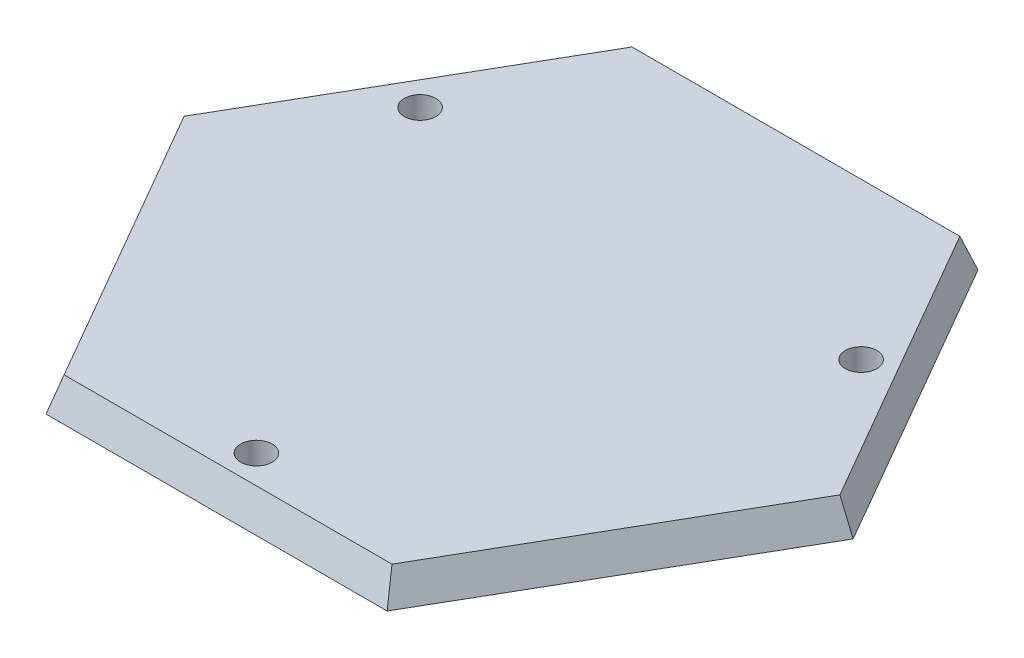
ISO-10303-21;
HEADER;
FILE_DESCRIPTION(('STEP AP214'),'2;1');
FILE_NAME('part.step','',(''),(''),'','','');
FILE_SCHEMA(('AUTOMOTIVE_DESIGN { 1 0 10303 214 1 1 1 1 }'));
ENDSEC;
DATA;
#1=APPLICATION_CONTEXT('core data for automotive mechanical design processes');
#2=APPLICATION_PROTOCOL_DEFINITION('international standard','automotive_design',2000,#1);
#3=PRODUCT_CONTEXT('',#1,'mechanical');
#4=PRODUCT('Part','Part','',(#3));
#5=PRODUCT_RELATED_PRODUCT_CATEGORY('part','',(#4));
#6=PRODUCT_DEFINITION_FORMATION('','',#4);
#7=PRODUCT_DEFINITION_CONTEXT('part definition',#1,'design');
#8=PRODUCT_DEFINITION('design','',#6,#7);
#9=PRODUCT_DEFINITION_SHAPE('','',#8);
#10=(LENGTH_UNIT() NAMED_UNIT(*) SI_UNIT(.MILLI.,.METRE.));
#11=(NAMED_UNIT(*) PLANE_ANGLE_UNIT() SI_UNIT($,.RADIAN.));
#12=(NAMED_UNIT(*) SI_UNIT($,.STERADIAN.) SOLID_ANGLE_UNIT());
#13=UNCERTAINTY_MEASURE_WITH_UNIT(LENGTH_MEASURE(1.E-05),#10,'distance_accuracy_value','');
#14=(GEOMETRIC_REPRESENTATION_CONTEXT(3) GLOBAL_UNCERTAINTY_ASSIGNED_CONTEXT((#13)) GLOBAL_UNIT_ASSIGNED_CONTEXT((#10,
#11,#12)) REPRESENTATION_CONTEXT('',''));
#15=CARTESIAN_POINT('',(0.,0.,0.));
#16=DIRECTION('',(0.,0.,1.));
#17=DIRECTION('',(1.,0.,0.));
#18=AXIS2_PLACEMENT_3D('',#15,#16,#17);
#19=CARTESIAN_POINT('',(-51.9615242270663,0.,-89.9999999999999));
#20=DIRECTION('',(-0.813797681349373,0.342020143325669,-0.469846310392954));
#21=DIRECTION('',(-0.5,0.,0.866025403784438));
#22=AXIS2_PLACEMENT_3D('',#19,#20,#21);
#23=PLANE('',#22);
#24=DIRECTION('',(-0.5,0.,0.866025403784439));
#25=VECTOR('',#24,1.);
#26=CARTESIAN_POINT('',(-51.9615242270663,0.,-89.9999999999999));
#27=LINE('',#26,#25);
#28=CARTESIAN_POINT('',(-51.9615242270663,0.,-89.9999999999999));
#29=VERTEX_POINT('',#28);
#30=CARTESIAN_POINT('',(-103.923048454133,0.,0.));
#31=VERTEX_POINT('',#30);
#32=EDGE_CURVE('E102',#29,#31,#27,.T.);
#33=ORIENTED_EDGE('',*,*,#32,.F.);
#34=DIRECTION('',(0.193724626205288,0.921891033043757,0.335540895264848));
#35=VECTOR('',#34,1.);
#36=CARTESIAN_POINT('',(-48.0613721563601,18.5599285538483,-83.2447384562918));
#37=LINE('',#36,#35);
#38=CARTESIAN_POINT('',(-54.0629073543724,-10.,-93.6397023426619));
#39=VERTEX_POINT('',#38);
#40=EDGE_CURVE('E11',#39,#29,#37,.T.);
#41=ORIENTED_EDGE('',*,*,#40,.F.);
#42=DIRECTION('',(-0.5,0.,0.866025403784438));
#43=VECTOR('',#42,1.);
#44=CARTESIAN_POINT('',(-81.0943610315585,-10.,-46.819851171331));
#45=LINE('',#44,#43);
#46=CARTESIAN_POINT('',(-108.125814708745,-10.,0.));
#47=VERTEX_POINT('',#46);
#48=EDGE_CURVE('E104',#39,#47,#45,.T.);
#49=ORIENTED_EDGE('',*,*,#48,.T.);
#50=DIRECTION('',(0.387449252410576,0.921891033043757,0.));
#51=VECTOR('',#50,1.);
#52=CARTESIAN_POINT('',(-96.1227443127202,18.5599285538483,0.));
#53=LINE('',#52,#51);
#54=EDGE_CURVE('E80',#47,#31,#53,.T.);
#55=ORIENTED_EDGE('',*,*,#54,.T.);
#56=EDGE_LOOP('',(#33,#41,#49,#55));
#57=FACE_BOUND('',#56,.T.);
#58=ADVANCED_FACE('F37',(#57),#23,.T.);
#59=CARTESIAN_POINT('',(51.9615242270663,0.,-89.9999999999999));
#60=DIRECTION('',(0.,0.342020143325669,-0.939692620785908));
#61=DIRECTION('',(0.,0.939692620785908,0.342020143325669));
#62=AXIS2_PLACEMENT_3D('',#59,#60,#61);
#63=PLANE('',#62);
#64=DIRECTION('',(-1.,0.,0.));
#65=VECTOR('',#64,1.);
#66=CARTESIAN_POINT('',(51.9615242270663,0.,-89.9999999999999));
#67=LINE('',#66,#65);
#68=CARTESIAN_POINT('',(51.9615242270663,0.,-89.9999999999999));
#69=VERTEX_POINT('',#68);
#70=EDGE_CURVE('E115',#69,#29,#67,.T.);
#71=ORIENTED_EDGE('',*,*,#70,.F.);
#72=DIRECTION('',(-0.193724626205288,0.921891033043757,0.335540895264848));
#73=VECTOR('',#72,1.);
#74=CARTESIAN_POINT('',(48.0613721563601,18.5599285538483,-83.2447384562918));
#75=LINE('',#74,#73);
#76=CARTESIAN_POINT('',(54.0629073543724,-10.,-93.639702342662));
#77=VERTEX_POINT('',#76);
#78=EDGE_CURVE('E47',#77,#69,#75,.T.);
#79=ORIENTED_EDGE('',*,*,#78,.F.);
#80=DIRECTION('',(-1.,0.,0.));
#81=VECTOR('',#80,1.);
#82=CARTESIAN_POINT('',(0.,-10.,-93.639702342662));
#83=LINE('',#82,#81);
#84=EDGE_CURVE('E105',#77,#39,#83,.T.);
#85=ORIENTED_EDGE('',*,*,#84,.T.);
#86=ORIENTED_EDGE('',*,*,#40,.T.);
#87=EDGE_LOOP('',(#71,#79,#85,#86));
#88=FACE_BOUND('',#87,.T.);
#89=ADVANCED_FACE('F39',(#88),#63,.T.);
#90=CARTESIAN_POINT('',(103.923048454133,0.,0.));
#91=DIRECTION('',(0.813797681349373,0.342020143325669,-0.469846310392954));
#92=DIRECTION('',(-0.5,0.,-0.866025403784439));
#93=AXIS2_PLACEMENT_3D('',#90,#91,#92);
#94=PLANE('',#93);
#95=DIRECTION('',(-0.5,0.,-0.866025403784439));
#96=VECTOR('',#95,1.);
#97=CARTESIAN_POINT('',(103.923048454133,0.,0.));
#98=LINE('',#97,#96);
#99=CARTESIAN_POINT('',(103.923048454133,0.,0.));
#100=VERTEX_POINT('',#99);
#101=EDGE_CURVE('E129',#100,#69,#98,.T.);
#102=ORIENTED_EDGE('',*,*,#101,.F.);
#103=DIRECTION('',(-0.387449252410576,0.921891033043757,0.));
#104=VECTOR('',#103,1.);
#105=CARTESIAN_POINT('',(96.1227443127201,18.5599285538483,0.));
#106=LINE('',#105,#104);
#107=CARTESIAN_POINT('',(108.125814708745,-10.,0.));
#108=VERTEX_POINT('',#107);
#109=EDGE_CURVE('E135',#108,#100,#106,.T.);
#110=ORIENTED_EDGE('',*,*,#109,.F.);
#111=DIRECTION('',(-0.5,0.,-0.866025403784439));
#112=VECTOR('',#111,1.);
#113=CARTESIAN_POINT('',(81.0943610315585,-10.,-46.819851171331));
#114=LINE('',#113,#112);
#115=EDGE_CURVE('E140',#108,#77,#114,.T.);
#116=ORIENTED_EDGE('',*,*,#115,.T.);
#117=ORIENTED_EDGE('',*,*,#78,.T.);
#118=EDGE_LOOP('',(#102,#110,#116,#117));
#119=FACE_BOUND('',#118,.T.);
#120=ADVANCED_FACE('F154',(#119),#94,.T.);
#121=CARTESIAN_POINT('',(51.9615242270663,0.,90.));
#122=DIRECTION('',(0.813797681349373,0.342020143325669,0.469846310392954));
#123=DIRECTION('',(0.5,0.,-0.866025403784439));
#124=AXIS2_PLACEMENT_3D('',#121,#122,#123);
#125=PLANE('',#124);
#126=DIRECTION('',(0.5,0.,-0.866025403784439));
#127=VECTOR('',#126,1.);
#128=CARTESIAN_POINT('',(51.9615242270663,0.,90.));
#129=LINE('',#128,#127);
#130=CARTESIAN_POINT('',(51.9615242270663,0.,90.));
#131=VERTEX_POINT('',#130);
#132=EDGE_CURVE('E126',#131,#100,#129,.T.);
#133=ORIENTED_EDGE('',*,*,#132,.F.);
#134=DIRECTION('',(-0.193724626205288,0.921891033043757,-0.335540895264848));
#135=VECTOR('',#134,1.);
#136=CARTESIAN_POINT('',(48.06137215636,18.5599285538483,83.2447384562918));
#137=LINE('',#136,#135);
#138=CARTESIAN_POINT('',(54.0629073543723,-10.,93.639702342662));
#139=VERTEX_POINT('',#138);
#140=EDGE_CURVE('E133',#139,#131,#137,.T.);
#141=ORIENTED_EDGE('',*,*,#140,.F.);
#142=DIRECTION('',(0.5,0.,-0.866025403784439));
#143=VECTOR('',#142,1.);
#144=CARTESIAN_POINT('',(81.0943610315585,-10.,46.819851171331));
#145=LINE('',#144,#143);
#146=EDGE_CURVE('E142',#139,#108,#145,.T.);
#147=ORIENTED_EDGE('',*,*,#146,.T.);
#148=ORIENTED_EDGE('',*,*,#109,.T.);
#149=EDGE_LOOP('',(#133,#141,#147,#148));
#150=FACE_BOUND('',#149,.T.);
#151=ADVANCED_FACE('F152',(#150),#125,.T.);
#152=CARTESIAN_POINT('',(-51.9615242270663,0.,90.));
#153=DIRECTION('',(0.,0.342020143325669,0.939692620785908));
#154=DIRECTION('',(0.,-0.939692620785908,0.342020143325669));
#155=AXIS2_PLACEMENT_3D('',#152,#153,#154);
#156=PLANE('',#155);
#157=DIRECTION('',(1.,0.,0.));
#158=VECTOR('',#157,1.);
#159=CARTESIAN_POINT('',(-51.9615242270663,0.,90.));
#160=LINE('',#159,#158);
#161=CARTESIAN_POINT('',(-51.9615242270663,0.,90.));
#162=VERTEX_POINT('',#161);
#163=EDGE_CURVE('E112',#162,#131,#160,.T.);
#164=ORIENTED_EDGE('',*,*,#163,.F.);
#165=DIRECTION('',(0.193724626205288,0.921891033043757,-0.335540895264848));
#166=VECTOR('',#165,1.);
#167=CARTESIAN_POINT('',(-48.06137215636,18.5599285538483,83.2447384562919));
#168=LINE('',#167,#166);
#169=CARTESIAN_POINT('',(-54.0629073543723,-10.,93.639702342662));
#170=VERTEX_POINT('',#169);
#171=EDGE_CURVE('E73',#170,#162,#168,.T.);
#172=ORIENTED_EDGE('',*,*,#171,.F.);
#173=DIRECTION('',(1.,0.,0.));
#174=VECTOR('',#173,1.);
#175=CARTESIAN_POINT('',(0.,-10.,93.639702342662));
#176=LINE('',#175,#174);
#177=EDGE_CURVE('E144',#170,#139,#176,.T.);
#178=ORIENTED_EDGE('',*,*,#177,.T.);
#179=ORIENTED_EDGE('',*,*,#140,.T.);
#180=EDGE_LOOP('',(#164,#172,#178,#179));
#181=FACE_BOUND('',#180,.T.);
#182=ADVANCED_FACE('F153',(#181),#156,.T.);
#183=CARTESIAN_POINT('',(-103.923048454133,0.,0.));
#184=DIRECTION('',(-0.813797681349373,0.342020143325669,0.469846310392954));
#185=DIRECTION('',(0.5,0.,0.866025403784439));
#186=AXIS2_PLACEMENT_3D('',#183,#184,#185);
#187=PLANE('',#186);
#188=DIRECTION('',(0.5,0.,0.866025403784439));
#189=VECTOR('',#188,1.);
#190=CARTESIAN_POINT('',(-103.923048454133,0.,0.));
#191=LINE('',#190,#189);
#192=EDGE_CURVE('E108',#31,#162,#191,.T.);
#193=ORIENTED_EDGE('',*,*,#192,.F.);
#194=ORIENTED_EDGE('',*,*,#54,.F.);
#195=DIRECTION('',(0.5,0.,0.866025403784439));
#196=VECTOR('',#195,1.);
#197=CARTESIAN_POINT('',(-81.0943610315585,-10.,46.819851171331));
#198=LINE('',#197,#196);
#199=EDGE_CURVE('E41',#47,#170,#198,.T.);
#200=ORIENTED_EDGE('',*,*,#199,.T.);
#201=ORIENTED_EDGE('',*,*,#171,.T.);
#202=EDGE_LOOP('',(#193,#194,#200,#201));
#203=FACE_BOUND('',#202,.T.);
#204=ADVANCED_FACE('F109',(#203),#187,.T.);
#205=CARTESIAN_POINT('',(0.,-10.,0.));
#206=DIRECTION('',(0.,1.,0.));
#207=DIRECTION('',(0.,0.,1.));
#208=AXIS2_PLACEMENT_3D('',#205,#206,#207);
#209=PLANE('',#208);
#210=CARTESIAN_POINT('',(-68.9422863405994,-10.,-39.8038475772933));
#211=DIRECTION('',(0.,1.,0.));
#212=DIRECTION('',(0.,0.,1.));
#213=AXIS2_PLACEMENT_3D('',#210,#211,#212);
#214=CIRCLE('',#213,5.00000000000001);
#215=CARTESIAN_POINT('',(-68.9422863405994,-10.,-34.8038475772933));
#216=VERTEX_POINT('',#215);
#217=EDGE_CURVE('E116',#216,#216,#214,.F.);
#218=ORIENTED_EDGE('',*,*,#217,.F.);
#219=EDGE_LOOP('',(#218));
#220=FACE_BOUND('',#219,.T.);
#221=CARTESIAN_POINT('',(70.1480577065395,-10.,-40.5));
#222=DIRECTION('',(0.,1.,0.));
#223=DIRECTION('',(0.,0.,1.));
#224=AXIS2_PLACEMENT_3D('',#221,#222,#223);
#225=CIRCLE('',#224,5.00000000000002);
#226=CARTESIAN_POINT('',(70.1480577065395,-10.,-35.5));
#227=VERTEX_POINT('',#226);
#228=EDGE_CURVE('E256',#227,#227,#225,.F.);
#229=ORIENTED_EDGE('',*,*,#228,.F.);
#230=EDGE_LOOP('',(#229));
#231=FACE_BOUND('',#230,.T.);
#232=CARTESIAN_POINT('',(0.,-10.,81.));
#233=DIRECTION('',(0.,1.,0.));
#234=DIRECTION('',(0.,0.,1.));
#235=AXIS2_PLACEMENT_3D('',#232,#233,#234);
#236=CIRCLE('',#235,5.);
#237=CARTESIAN_POINT('',(0.,-10.,86.));
#238=VERTEX_POINT('',#237);
#239=EDGE_CURVE('E260',#238,#238,#236,.F.);
#240=ORIENTED_EDGE('',*,*,#239,.F.);
#241=EDGE_LOOP('',(#240));
#242=FACE_BOUND('',#241,.T.);
#243=ORIENTED_EDGE('',*,*,#48,.F.);
#244=ORIENTED_EDGE('',*,*,#84,.F.);
#245=ORIENTED_EDGE('',*,*,#115,.F.);
#246=ORIENTED_EDGE('',*,*,#146,.F.);
#247=ORIENTED_EDGE('',*,*,#177,.F.);
#248=ORIENTED_EDGE('',*,*,#199,.F.);
#249=EDGE_LOOP('',(#243,#244,#245,#246,#247,#248));
#250=FACE_BOUND('',#249,.T.);
#251=ADVANCED_FACE('F146',(#220,#231,#242,#250),#209,.F.);
#252=CARTESIAN_POINT('',(0.,0.,0.));
#253=DIRECTION('',(0.,1.,0.));
#254=DIRECTION('',(0.,0.,1.));
#255=AXIS2_PLACEMENT_3D('',#252,#253,#254);
#256=PLANE('',#255);
#257=CARTESIAN_POINT('',(-68.9422863405994,0.,-39.8038475772933));
#258=DIRECTION('',(0.,1.,0.));
#259=DIRECTION('',(0.,0.,1.));
#260=AXIS2_PLACEMENT_3D('',#257,#258,#259);
#261=CIRCLE('',#260,5.00000000000001);
#262=CARTESIAN_POINT('',(-68.9422863405994,0.,-34.8038475772933));
#263=VERTEX_POINT('',#262);
#264=EDGE_CURVE('E119',#263,#263,#261,.T.);
#265=ORIENTED_EDGE('',*,*,#264,.F.);
#266=EDGE_LOOP('',(#265));
#267=FACE_BOUND('',#266,.T.);
#268=CARTESIAN_POINT('',(70.1480577065395,0.,-40.5));
#269=DIRECTION('',(0.,1.,0.));
#270=DIRECTION('',(0.,0.,1.));
#271=AXIS2_PLACEMENT_3D('',#268,#269,#270);
#272=CIRCLE('',#271,5.00000000000002);
#273=CARTESIAN_POINT('',(70.1480577065395,0.,-35.5));
#274=VERTEX_POINT('',#273);
#275=EDGE_CURVE('E253',#274,#274,#272,.T.);
#276=ORIENTED_EDGE('',*,*,#275,.F.);
#277=EDGE_LOOP('',(#276));
#278=FACE_BOUND('',#277,.T.);
#279=CARTESIAN_POINT('',(0.,0.,81.));
#280=DIRECTION('',(0.,1.,0.));
#281=DIRECTION('',(0.,0.,1.));
#282=AXIS2_PLACEMENT_3D('',#279,#280,#281);
#283=CIRCLE('',#282,5.);
#284=CARTESIAN_POINT('',(0.,0.,86.));
#285=VERTEX_POINT('',#284);
#286=EDGE_CURVE('E122',#285,#285,#283,.T.);
#287=ORIENTED_EDGE('',*,*,#286,.F.);
#288=EDGE_LOOP('',(#287));
#289=FACE_BOUND('',#288,.T.);
#290=ORIENTED_EDGE('',*,*,#32,.T.);
#291=ORIENTED_EDGE('',*,*,#192,.T.);
#292=ORIENTED_EDGE('',*,*,#163,.T.);
#293=ORIENTED_EDGE('',*,*,#132,.T.);
#294=ORIENTED_EDGE('',*,*,#101,.T.);
#295=ORIENTED_EDGE('',*,*,#70,.T.);
#296=EDGE_LOOP('',(#290,#291,#292,#293,#294,#295));
#297=FACE_BOUND('',#296,.T.);
#298=ADVANCED_FACE('F114',(#267,#278,#289,#297),#256,.T.);
#299=CARTESIAN_POINT('',(0.,-24.142135623731,81.));
#300=DIRECTION('',(0.,1.,0.));
#301=DIRECTION('',(0.,0.,1.));
#302=AXIS2_PLACEMENT_3D('',#299,#300,#301);
#303=CYLINDRICAL_SURFACE('',#302,5.);
#304=ORIENTED_EDGE('',*,*,#239,.T.);
#305=EDGE_LOOP('',(#304));
#306=FACE_BOUND('',#305,.T.);
#307=ORIENTED_EDGE('',*,*,#286,.T.);
#308=EDGE_LOOP('',(#307));
#309=FACE_BOUND('',#308,.T.);
#310=ADVANCED_FACE('F191',(#306,#309),#303,.F.);
#311=CARTESIAN_POINT('',(70.1480577065395,-24.142135623731,-40.5));
#312=DIRECTION('',(0.,1.,0.));
#313=DIRECTION('',(0.,0.,1.));
#314=AXIS2_PLACEMENT_3D('',#311,#312,#313);
#315=CYLINDRICAL_SURFACE('',#314,5.00000000000002);
#316=ORIENTED_EDGE('',*,*,#228,.T.);
#317=EDGE_LOOP('',(#316));
#318=FACE_BOUND('',#317,.T.);
#319=ORIENTED_EDGE('',*,*,#275,.T.);
#320=EDGE_LOOP('',(#319));
#321=FACE_BOUND('',#320,.T.);
#322=ADVANCED_FACE('F198',(#318,#321),#315,.F.);
#323=CARTESIAN_POINT('',(-68.9422863405994,-24.142135623731,-39.8038475772933));
#324=DIRECTION('',(0.,1.,0.));
#325=DIRECTION('',(0.,0.,1.));
#326=AXIS2_PLACEMENT_3D('',#323,#324,#325);
#327=CYLINDRICAL_SURFACE('',#326,5.00000000000001);
#328=ORIENTED_EDGE('',*,*,#217,.T.);
#329=EDGE_LOOP('',(#328));
#330=FACE_BOUND('',#329,.T.);
#331=ORIENTED_EDGE('',*,*,#264,.T.);
#332=EDGE_LOOP('',(#331));
#333=FACE_BOUND('',#332,.T.);
#334=ADVANCED_FACE('F206',(#330,#333),#327,.F.);
#335=CLOSED_SHELL('',(#58,#89,#120,#151,#182,#204,#251,#298,#310,#322,#334));
#336=MANIFOLD_SOLID_BREP('B2',#335);
#337=ADVANCED_BREP_SHAPE_REPRESENTATION('',(#18,#336),#14);
#338=SHAPE_DEFINITION_REPRESENTATION(#9,#337);
ENDSEC;
END-ISO-10303-21;
